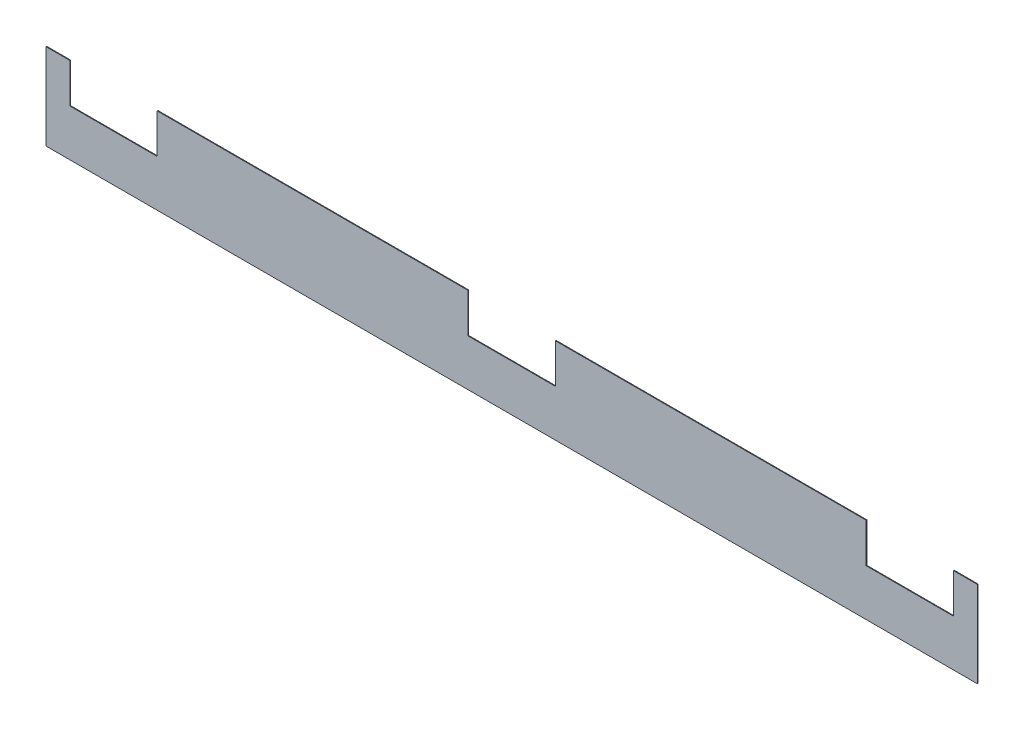
ISO-10303-21;
HEADER;
FILE_DESCRIPTION(('STEP AP214'),'2;1');
FILE_NAME('part.step','',(''),(''),'','','');
FILE_SCHEMA(('AUTOMOTIVE_DESIGN { 1 0 10303 214 1 1 1 1 }'));
ENDSEC;
DATA;
#1=APPLICATION_CONTEXT('core data for automotive mechanical design processes');
#2=APPLICATION_PROTOCOL_DEFINITION('international standard','automotive_design',2000,#1);
#3=PRODUCT_CONTEXT('',#1,'mechanical');
#4=PRODUCT('Part','Part','',(#3));
#5=PRODUCT_RELATED_PRODUCT_CATEGORY('part','',(#4));
#6=PRODUCT_DEFINITION_FORMATION('','',#4);
#7=PRODUCT_DEFINITION_CONTEXT('part definition',#1,'design');
#8=PRODUCT_DEFINITION('design','',#6,#7);
#9=PRODUCT_DEFINITION_SHAPE('','',#8);
#10=(LENGTH_UNIT() NAMED_UNIT(*) SI_UNIT(.MILLI.,.METRE.));
#11=(NAMED_UNIT(*) PLANE_ANGLE_UNIT() SI_UNIT($,.RADIAN.));
#12=(NAMED_UNIT(*) SI_UNIT($,.STERADIAN.) SOLID_ANGLE_UNIT());
#13=UNCERTAINTY_MEASURE_WITH_UNIT(LENGTH_MEASURE(1.E-05),#10,'distance_accuracy_value','');
#14=(GEOMETRIC_REPRESENTATION_CONTEXT(3) GLOBAL_UNCERTAINTY_ASSIGNED_CONTEXT((#13)) GLOBAL_UNIT_ASSIGNED_CONTEXT((#10,
#11,#12)) REPRESENTATION_CONTEXT('',''));
#15=CARTESIAN_POINT('',(0.,0.,0.));
#16=DIRECTION('',(0.,0.,1.));
#17=DIRECTION('',(1.,0.,0.));
#18=AXIS2_PLACEMENT_3D('',#15,#16,#17);
#19=CARTESIAN_POINT('',(0.,360.,3.));
#20=DIRECTION('',(-1.,0.,0.));
#21=DIRECTION('',(0.,-1.,0.));
#22=AXIS2_PLACEMENT_3D('',#19,#20,#21);
#23=PLANE('',#22);
#24=DIRECTION('',(0.,1.,0.));
#25=VECTOR('',#24,1.);
#26=CARTESIAN_POINT('',(0.,360.,0.));
#27=LINE('',#26,#25);
#28=CARTESIAN_POINT('',(0.,0.,0.));
#29=VERTEX_POINT('',#28);
#30=CARTESIAN_POINT('',(0.,360.,0.));
#31=VERTEX_POINT('',#30);
#32=EDGE_CURVE('E177',#29,#31,#27,.T.);
#33=ORIENTED_EDGE('',*,*,#32,.T.);
#34=DIRECTION('',(0.,0.,-1.));
#35=VECTOR('',#34,1.);
#36=CARTESIAN_POINT('',(0.,360.,3.));
#37=LINE('',#36,#35);
#38=CARTESIAN_POINT('',(0.,360.,3.));
#39=VERTEX_POINT('',#38);
#40=EDGE_CURVE('E11',#39,#31,#37,.T.);
#41=ORIENTED_EDGE('',*,*,#40,.F.);
#42=DIRECTION('',(0.,1.,0.));
#43=VECTOR('',#42,1.);
#44=CARTESIAN_POINT('',(0.,360.,3.));
#45=LINE('',#44,#43);
#46=CARTESIAN_POINT('',(0.,0.,3.));
#47=VERTEX_POINT('',#46);
#48=EDGE_CURVE('E207',#47,#39,#45,.T.);
#49=ORIENTED_EDGE('',*,*,#48,.F.);
#50=DIRECTION('',(0.,0.,-1.));
#51=VECTOR('',#50,1.);
#52=CARTESIAN_POINT('',(0.,0.,3.));
#53=LINE('',#52,#51);
#54=EDGE_CURVE('E173',#47,#29,#53,.T.);
#55=ORIENTED_EDGE('',*,*,#54,.T.);
#56=EDGE_LOOP('',(#33,#41,#49,#55));
#57=FACE_BOUND('',#56,.T.);
#58=ADVANCED_FACE('F33',(#57),#23,.F.);
#59=CARTESIAN_POINT('',(-100.,360.,3.));
#60=DIRECTION('',(0.,-1.,0.));
#61=DIRECTION('',(0.,0.,-1.));
#62=AXIS2_PLACEMENT_3D('',#59,#60,#61);
#63=PLANE('',#62);
#64=DIRECTION('',(-1.,0.,0.));
#65=VECTOR('',#64,1.);
#66=CARTESIAN_POINT('',(-100.,360.,0.));
#67=LINE('',#66,#65);
#68=CARTESIAN_POINT('',(-100.,360.,0.));
#69=VERTEX_POINT('',#68);
#70=EDGE_CURVE('E180',#31,#69,#67,.T.);
#71=ORIENTED_EDGE('',*,*,#70,.T.);
#72=DIRECTION('',(0.,0.,-1.));
#73=VECTOR('',#72,1.);
#74=CARTESIAN_POINT('',(-100.,360.,3.));
#75=LINE('',#74,#73);
#76=CARTESIAN_POINT('',(-100.,360.,3.));
#77=VERTEX_POINT('',#76);
#78=EDGE_CURVE('E41',#77,#69,#75,.T.);
#79=ORIENTED_EDGE('',*,*,#78,.F.);
#80=DIRECTION('',(-1.,0.,0.));
#81=VECTOR('',#80,1.);
#82=CARTESIAN_POINT('',(-100.,360.,3.));
#83=LINE('',#82,#81);
#84=EDGE_CURVE('E116',#39,#77,#83,.T.);
#85=ORIENTED_EDGE('',*,*,#84,.F.);
#86=ORIENTED_EDGE('',*,*,#40,.T.);
#87=EDGE_LOOP('',(#71,#79,#85,#86));
#88=FACE_BOUND('',#87,.T.);
#89=ADVANCED_FACE('F305',(#88),#63,.F.);
#90=CARTESIAN_POINT('',(-100.,195.,3.));
#91=DIRECTION('',(1.,0.,0.));
#92=DIRECTION('',(0.,0.,-1.));
#93=AXIS2_PLACEMENT_3D('',#90,#91,#92);
#94=PLANE('',#93);
#95=DIRECTION('',(0.,-1.,0.));
#96=VECTOR('',#95,1.);
#97=CARTESIAN_POINT('',(-100.,195.,0.));
#98=LINE('',#97,#96);
#99=CARTESIAN_POINT('',(-100.,195.,0.));
#100=VERTEX_POINT('',#99);
#101=EDGE_CURVE('E182',#69,#100,#98,.T.);
#102=ORIENTED_EDGE('',*,*,#101,.T.);
#103=DIRECTION('',(0.,0.,-1.));
#104=VECTOR('',#103,1.);
#105=CARTESIAN_POINT('',(-100.,195.,3.));
#106=LINE('',#105,#104);
#107=CARTESIAN_POINT('',(-100.,195.,3.));
#108=VERTEX_POINT('',#107);
#109=EDGE_CURVE('E238',#108,#100,#106,.T.);
#110=ORIENTED_EDGE('',*,*,#109,.F.);
#111=DIRECTION('',(0.,-1.,0.));
#112=VECTOR('',#111,1.);
#113=CARTESIAN_POINT('',(-100.,195.,3.));
#114=LINE('',#113,#112);
#115=EDGE_CURVE('E246',#77,#108,#114,.T.);
#116=ORIENTED_EDGE('',*,*,#115,.F.);
#117=ORIENTED_EDGE('',*,*,#78,.T.);
#118=EDGE_LOOP('',(#102,#110,#116,#117));
#119=FACE_BOUND('',#118,.T.);
#120=ADVANCED_FACE('F244',(#119),#94,.F.);
#121=CARTESIAN_POINT('',(-465.,195.,3.));
#122=DIRECTION('',(0.,-1.,0.));
#123=DIRECTION('',(1.,0.,0.));
#124=AXIS2_PLACEMENT_3D('',#121,#122,#123);
#125=PLANE('',#124);
#126=DIRECTION('',(-1.,0.,0.));
#127=VECTOR('',#126,1.);
#128=CARTESIAN_POINT('',(-465.,195.,0.));
#129=LINE('',#128,#127);
#130=CARTESIAN_POINT('',(-465.,195.,0.));
#131=VERTEX_POINT('',#130);
#132=EDGE_CURVE('E184',#100,#131,#129,.T.);
#133=ORIENTED_EDGE('',*,*,#132,.T.);
#134=DIRECTION('',(0.,0.,-1.));
#135=VECTOR('',#134,1.);
#136=CARTESIAN_POINT('',(-465.,195.,3.));
#137=LINE('',#136,#135);
#138=CARTESIAN_POINT('',(-465.,195.,3.));
#139=VERTEX_POINT('',#138);
#140=EDGE_CURVE('E235',#139,#131,#137,.T.);
#141=ORIENTED_EDGE('',*,*,#140,.F.);
#142=DIRECTION('',(-1.,0.,0.));
#143=VECTOR('',#142,1.);
#144=CARTESIAN_POINT('',(-465.,195.,3.));
#145=LINE('',#144,#143);
#146=EDGE_CURVE('E264',#108,#139,#145,.T.);
#147=ORIENTED_EDGE('',*,*,#146,.F.);
#148=ORIENTED_EDGE('',*,*,#109,.T.);
#149=EDGE_LOOP('',(#133,#141,#147,#148));
#150=FACE_BOUND('',#149,.T.);
#151=ADVANCED_FACE('F255',(#150),#125,.F.);
#152=CARTESIAN_POINT('',(-465.,360.,3.));
#153=DIRECTION('',(-1.,0.,0.));
#154=DIRECTION('',(0.,0.,1.));
#155=AXIS2_PLACEMENT_3D('',#152,#153,#154);
#156=PLANE('',#155);
#157=DIRECTION('',(0.,1.,0.));
#158=VECTOR('',#157,1.);
#159=CARTESIAN_POINT('',(-465.,360.,0.));
#160=LINE('',#159,#158);
#161=CARTESIAN_POINT('',(-465.,360.,0.));
#162=VERTEX_POINT('',#161);
#163=EDGE_CURVE('E186',#131,#162,#160,.T.);
#164=ORIENTED_EDGE('',*,*,#163,.T.);
#165=DIRECTION('',(0.,0.,-1.));
#166=VECTOR('',#165,1.);
#167=CARTESIAN_POINT('',(-465.,360.,3.));
#168=LINE('',#167,#166);
#169=CARTESIAN_POINT('',(-465.,360.,3.));
#170=VERTEX_POINT('',#169);
#171=EDGE_CURVE('E232',#170,#162,#168,.T.);
#172=ORIENTED_EDGE('',*,*,#171,.F.);
#173=DIRECTION('',(0.,1.,0.));
#174=VECTOR('',#173,1.);
#175=CARTESIAN_POINT('',(-465.,360.,3.));
#176=LINE('',#175,#174);
#177=EDGE_CURVE('E261',#139,#170,#176,.T.);
#178=ORIENTED_EDGE('',*,*,#177,.F.);
#179=ORIENTED_EDGE('',*,*,#140,.T.);
#180=EDGE_LOOP('',(#164,#172,#178,#179));
#181=FACE_BOUND('',#180,.T.);
#182=ADVANCED_FACE('F259',(#181),#156,.F.);
#183=CARTESIAN_POINT('',(-1765.,360.,3.));
#184=DIRECTION('',(0.,-1.,0.));
#185=DIRECTION('',(1.,0.,0.));
#186=AXIS2_PLACEMENT_3D('',#183,#184,#185);
#187=PLANE('',#186);
#188=DIRECTION('',(-1.,0.,0.));
#189=VECTOR('',#188,1.);
#190=CARTESIAN_POINT('',(-1765.,360.,0.));
#191=LINE('',#190,#189);
#192=CARTESIAN_POINT('',(-1765.,360.,0.));
#193=VERTEX_POINT('',#192);
#194=EDGE_CURVE('E188',#162,#193,#191,.T.);
#195=ORIENTED_EDGE('',*,*,#194,.T.);
#196=DIRECTION('',(0.,0.,-1.));
#197=VECTOR('',#196,1.);
#198=CARTESIAN_POINT('',(-1765.,360.,3.));
#199=LINE('',#198,#197);
#200=CARTESIAN_POINT('',(-1765.,360.,3.));
#201=VERTEX_POINT('',#200);
#202=EDGE_CURVE('E229',#201,#193,#199,.T.);
#203=ORIENTED_EDGE('',*,*,#202,.F.);
#204=DIRECTION('',(-1.,0.,0.));
#205=VECTOR('',#204,1.);
#206=CARTESIAN_POINT('',(-1765.,360.,3.));
#207=LINE('',#206,#205);
#208=EDGE_CURVE('E263',#170,#201,#207,.T.);
#209=ORIENTED_EDGE('',*,*,#208,.F.);
#210=ORIENTED_EDGE('',*,*,#171,.T.);
#211=EDGE_LOOP('',(#195,#203,#209,#210));
#212=FACE_BOUND('',#211,.T.);
#213=ADVANCED_FACE('F318',(#212),#187,.F.);
#214=CARTESIAN_POINT('',(-1765.,195.,3.));
#215=DIRECTION('',(1.,0.,0.));
#216=DIRECTION('',(0.,0.,-1.));
#217=AXIS2_PLACEMENT_3D('',#214,#215,#216);
#218=PLANE('',#217);
#219=DIRECTION('',(0.,-1.,0.));
#220=VECTOR('',#219,1.);
#221=CARTESIAN_POINT('',(-1765.,195.,0.));
#222=LINE('',#221,#220);
#223=CARTESIAN_POINT('',(-1765.,195.,0.));
#224=VERTEX_POINT('',#223);
#225=EDGE_CURVE('E190',#193,#224,#222,.T.);
#226=ORIENTED_EDGE('',*,*,#225,.T.);
#227=DIRECTION('',(0.,0.,-1.));
#228=VECTOR('',#227,1.);
#229=CARTESIAN_POINT('',(-1765.,195.,3.));
#230=LINE('',#229,#228);
#231=CARTESIAN_POINT('',(-1765.,195.,3.));
#232=VERTEX_POINT('',#231);
#233=EDGE_CURVE('E226',#232,#224,#230,.T.);
#234=ORIENTED_EDGE('',*,*,#233,.F.);
#235=DIRECTION('',(0.,-1.,0.));
#236=VECTOR('',#235,1.);
#237=CARTESIAN_POINT('',(-1765.,195.,3.));
#238=LINE('',#237,#236);
#239=EDGE_CURVE('E266',#201,#232,#238,.T.);
#240=ORIENTED_EDGE('',*,*,#239,.F.);
#241=ORIENTED_EDGE('',*,*,#202,.T.);
#242=EDGE_LOOP('',(#226,#234,#240,#241));
#243=FACE_BOUND('',#242,.T.);
#244=ADVANCED_FACE('F321',(#243),#218,.F.);
#245=CARTESIAN_POINT('',(-2130.,195.,3.));
#246=DIRECTION('',(0.,-1.,0.));
#247=DIRECTION('',(1.,0.,0.));
#248=AXIS2_PLACEMENT_3D('',#245,#246,#247);
#249=PLANE('',#248);
#250=DIRECTION('',(-1.,0.,0.));
#251=VECTOR('',#250,1.);
#252=CARTESIAN_POINT('',(-2130.,195.,0.));
#253=LINE('',#252,#251);
#254=CARTESIAN_POINT('',(-2130.,195.,0.));
#255=VERTEX_POINT('',#254);
#256=EDGE_CURVE('E192',#224,#255,#253,.T.);
#257=ORIENTED_EDGE('',*,*,#256,.T.);
#258=DIRECTION('',(0.,0.,-1.));
#259=VECTOR('',#258,1.);
#260=CARTESIAN_POINT('',(-2130.,195.,3.));
#261=LINE('',#260,#259);
#262=CARTESIAN_POINT('',(-2130.,195.,3.));
#263=VERTEX_POINT('',#262);
#264=EDGE_CURVE('E223',#263,#255,#261,.T.);
#265=ORIENTED_EDGE('',*,*,#264,.F.);
#266=DIRECTION('',(-1.,0.,0.));
#267=VECTOR('',#266,1.);
#268=CARTESIAN_POINT('',(-2130.,195.,3.));
#269=LINE('',#268,#267);
#270=EDGE_CURVE('E272',#232,#263,#269,.T.);
#271=ORIENTED_EDGE('',*,*,#270,.F.);
#272=ORIENTED_EDGE('',*,*,#233,.T.);
#273=EDGE_LOOP('',(#257,#265,#271,#272));
#274=FACE_BOUND('',#273,.T.);
#275=ADVANCED_FACE('F325',(#274),#249,.F.);
#276=CARTESIAN_POINT('',(-2130.,360.,3.));
#277=DIRECTION('',(-1.,0.,0.));
#278=DIRECTION('',(0.,0.,1.));
#279=AXIS2_PLACEMENT_3D('',#276,#277,#278);
#280=PLANE('',#279);
#281=DIRECTION('',(0.,1.,0.));
#282=VECTOR('',#281,1.);
#283=CARTESIAN_POINT('',(-2130.,360.,0.));
#284=LINE('',#283,#282);
#285=CARTESIAN_POINT('',(-2130.,360.,0.));
#286=VERTEX_POINT('',#285);
#287=EDGE_CURVE('E194',#255,#286,#284,.T.);
#288=ORIENTED_EDGE('',*,*,#287,.T.);
#289=DIRECTION('',(0.,0.,-1.));
#290=VECTOR('',#289,1.);
#291=CARTESIAN_POINT('',(-2130.,360.,3.));
#292=LINE('',#291,#290);
#293=CARTESIAN_POINT('',(-2130.,360.,3.));
#294=VERTEX_POINT('',#293);
#295=EDGE_CURVE('E220',#294,#286,#292,.T.);
#296=ORIENTED_EDGE('',*,*,#295,.F.);
#297=DIRECTION('',(0.,1.,0.));
#298=VECTOR('',#297,1.);
#299=CARTESIAN_POINT('',(-2130.,360.,3.));
#300=LINE('',#299,#298);
#301=EDGE_CURVE('E274',#263,#294,#300,.T.);
#302=ORIENTED_EDGE('',*,*,#301,.F.);
#303=ORIENTED_EDGE('',*,*,#264,.T.);
#304=EDGE_LOOP('',(#288,#296,#302,#303));
#305=FACE_BOUND('',#304,.T.);
#306=ADVANCED_FACE('F329',(#305),#280,.F.);
#307=CARTESIAN_POINT('',(-3430.,360.,3.));
#308=DIRECTION('',(0.,-1.,0.));
#309=DIRECTION('',(0.,0.,-1.));
#310=AXIS2_PLACEMENT_3D('',#307,#308,#309);
#311=PLANE('',#310);
#312=DIRECTION('',(-1.,0.,0.));
#313=VECTOR('',#312,1.);
#314=CARTESIAN_POINT('',(-3430.,360.,0.));
#315=LINE('',#314,#313);
#316=CARTESIAN_POINT('',(-3430.,360.,0.));
#317=VERTEX_POINT('',#316);
#318=EDGE_CURVE('E196',#286,#317,#315,.T.);
#319=ORIENTED_EDGE('',*,*,#318,.T.);
#320=DIRECTION('',(0.,0.,-1.));
#321=VECTOR('',#320,1.);
#322=CARTESIAN_POINT('',(-3430.,360.,3.));
#323=LINE('',#322,#321);
#324=CARTESIAN_POINT('',(-3430.,360.,3.));
#325=VERTEX_POINT('',#324);
#326=EDGE_CURVE('E217',#325,#317,#323,.T.);
#327=ORIENTED_EDGE('',*,*,#326,.F.);
#328=DIRECTION('',(-1.,0.,0.));
#329=VECTOR('',#328,1.);
#330=CARTESIAN_POINT('',(-3430.,360.,3.));
#331=LINE('',#330,#329);
#332=EDGE_CURVE('E276',#294,#325,#331,.T.);
#333=ORIENTED_EDGE('',*,*,#332,.F.);
#334=ORIENTED_EDGE('',*,*,#295,.T.);
#335=EDGE_LOOP('',(#319,#327,#333,#334));
#336=FACE_BOUND('',#335,.T.);
#337=ADVANCED_FACE('F333',(#336),#311,.F.);
#338=CARTESIAN_POINT('',(-3430.,195.,3.));
#339=DIRECTION('',(1.,0.,0.));
#340=DIRECTION('',(0.,0.,-1.));
#341=AXIS2_PLACEMENT_3D('',#338,#339,#340);
#342=PLANE('',#341);
#343=DIRECTION('',(0.,-1.,0.));
#344=VECTOR('',#343,1.);
#345=CARTESIAN_POINT('',(-3430.,195.,0.));
#346=LINE('',#345,#344);
#347=CARTESIAN_POINT('',(-3430.,195.,0.));
#348=VERTEX_POINT('',#347);
#349=EDGE_CURVE('E198',#317,#348,#346,.T.);
#350=ORIENTED_EDGE('',*,*,#349,.T.);
#351=DIRECTION('',(0.,0.,-1.));
#352=VECTOR('',#351,1.);
#353=CARTESIAN_POINT('',(-3430.,195.,3.));
#354=LINE('',#353,#352);
#355=CARTESIAN_POINT('',(-3430.,195.,3.));
#356=VERTEX_POINT('',#355);
#357=EDGE_CURVE('E214',#356,#348,#354,.T.);
#358=ORIENTED_EDGE('',*,*,#357,.F.);
#359=DIRECTION('',(0.,-1.,0.));
#360=VECTOR('',#359,1.);
#361=CARTESIAN_POINT('',(-3430.,195.,3.));
#362=LINE('',#361,#360);
#363=EDGE_CURVE('E278',#325,#356,#362,.T.);
#364=ORIENTED_EDGE('',*,*,#363,.F.);
#365=ORIENTED_EDGE('',*,*,#326,.T.);
#366=EDGE_LOOP('',(#350,#358,#364,#365));
#367=FACE_BOUND('',#366,.T.);
#368=ADVANCED_FACE('F337',(#367),#342,.F.);
#369=CARTESIAN_POINT('',(-3795.,195.,3.));
#370=DIRECTION('',(0.,-1.,0.));
#371=DIRECTION('',(1.,0.,0.));
#372=AXIS2_PLACEMENT_3D('',#369,#370,#371);
#373=PLANE('',#372);
#374=DIRECTION('',(-1.,0.,0.));
#375=VECTOR('',#374,1.);
#376=CARTESIAN_POINT('',(-3795.,195.,0.));
#377=LINE('',#376,#375);
#378=CARTESIAN_POINT('',(-3795.,195.,0.));
#379=VERTEX_POINT('',#378);
#380=EDGE_CURVE('E200',#348,#379,#377,.T.);
#381=ORIENTED_EDGE('',*,*,#380,.T.);
#382=DIRECTION('',(0.,0.,-1.));
#383=VECTOR('',#382,1.);
#384=CARTESIAN_POINT('',(-3795.,195.,3.));
#385=LINE('',#384,#383);
#386=CARTESIAN_POINT('',(-3795.,195.,3.));
#387=VERTEX_POINT('',#386);
#388=EDGE_CURVE('E211',#387,#379,#385,.T.);
#389=ORIENTED_EDGE('',*,*,#388,.F.);
#390=DIRECTION('',(-1.,0.,0.));
#391=VECTOR('',#390,1.);
#392=CARTESIAN_POINT('',(-3795.,195.,3.));
#393=LINE('',#392,#391);
#394=EDGE_CURVE('E280',#356,#387,#393,.T.);
#395=ORIENTED_EDGE('',*,*,#394,.F.);
#396=ORIENTED_EDGE('',*,*,#357,.T.);
#397=EDGE_LOOP('',(#381,#389,#395,#396));
#398=FACE_BOUND('',#397,.T.);
#399=ADVANCED_FACE('F286',(#398),#373,.F.);
#400=CARTESIAN_POINT('',(-3795.,360.,3.));
#401=DIRECTION('',(-1.,0.,0.));
#402=DIRECTION('',(0.,0.,1.));
#403=AXIS2_PLACEMENT_3D('',#400,#401,#402);
#404=PLANE('',#403);
#405=DIRECTION('',(0.,1.,0.));
#406=VECTOR('',#405,1.);
#407=CARTESIAN_POINT('',(-3795.,360.,0.));
#408=LINE('',#407,#406);
#409=CARTESIAN_POINT('',(-3795.,360.,0.));
#410=VERTEX_POINT('',#409);
#411=EDGE_CURVE('E202',#379,#410,#408,.T.);
#412=ORIENTED_EDGE('',*,*,#411,.T.);
#413=DIRECTION('',(0.,0.,-1.));
#414=VECTOR('',#413,1.);
#415=CARTESIAN_POINT('',(-3795.,360.,3.));
#416=LINE('',#415,#414);
#417=CARTESIAN_POINT('',(-3795.,360.,3.));
#418=VERTEX_POINT('',#417);
#419=EDGE_CURVE('E168',#418,#410,#416,.T.);
#420=ORIENTED_EDGE('',*,*,#419,.F.);
#421=DIRECTION('',(0.,1.,0.));
#422=VECTOR('',#421,1.);
#423=CARTESIAN_POINT('',(-3795.,360.,3.));
#424=LINE('',#423,#422);
#425=EDGE_CURVE('E159',#387,#418,#424,.T.);
#426=ORIENTED_EDGE('',*,*,#425,.F.);
#427=ORIENTED_EDGE('',*,*,#388,.T.);
#428=EDGE_LOOP('',(#412,#420,#426,#427));
#429=FACE_BOUND('',#428,.T.);
#430=ADVANCED_FACE('F290',(#429),#404,.F.);
#431=CARTESIAN_POINT('',(-3895.,360.,3.));
#432=DIRECTION('',(0.,-1.,0.));
#433=DIRECTION('',(1.,0.,0.));
#434=AXIS2_PLACEMENT_3D('',#431,#432,#433);
#435=PLANE('',#434);
#436=DIRECTION('',(-1.,0.,0.));
#437=VECTOR('',#436,1.);
#438=CARTESIAN_POINT('',(-3895.,360.,0.));
#439=LINE('',#438,#437);
#440=CARTESIAN_POINT('',(-3895.,360.,0.));
#441=VERTEX_POINT('',#440);
#442=EDGE_CURVE('E167',#410,#441,#439,.T.);
#443=ORIENTED_EDGE('',*,*,#442,.T.);
#444=DIRECTION('',(0.,0.,-1.));
#445=VECTOR('',#444,1.);
#446=CARTESIAN_POINT('',(-3895.,360.,3.));
#447=LINE('',#446,#445);
#448=CARTESIAN_POINT('',(-3895.,360.,3.));
#449=VERTEX_POINT('',#448);
#450=EDGE_CURVE('E164',#449,#441,#447,.T.);
#451=ORIENTED_EDGE('',*,*,#450,.F.);
#452=DIRECTION('',(-1.,0.,0.));
#453=VECTOR('',#452,1.);
#454=CARTESIAN_POINT('',(-3895.,360.,3.));
#455=LINE('',#454,#453);
#456=EDGE_CURVE('E153',#418,#449,#455,.T.);
#457=ORIENTED_EDGE('',*,*,#456,.F.);
#458=ORIENTED_EDGE('',*,*,#419,.T.);
#459=EDGE_LOOP('',(#443,#451,#457,#458));
#460=FACE_BOUND('',#459,.T.);
#461=ADVANCED_FACE('F165',(#460),#435,.F.);
#462=CARTESIAN_POINT('',(-3895.,-8.63375993398884E-13,3.));
#463=DIRECTION('',(1.,0.,0.));
#464=DIRECTION('',(0.,0.,-1.));
#465=AXIS2_PLACEMENT_3D('',#462,#463,#464);
#466=PLANE('',#465);
#467=DIRECTION('',(0.,-1.,0.));
#468=VECTOR('',#467,1.);
#469=CARTESIAN_POINT('',(-3895.,-8.63375993398884E-13,0.));
#470=LINE('',#469,#468);
#471=CARTESIAN_POINT('',(-3895.,-8.63375993398884E-13,0.));
#472=VERTEX_POINT('',#471);
#473=EDGE_CURVE('E102',#441,#472,#470,.T.);
#474=ORIENTED_EDGE('',*,*,#473,.T.);
#475=DIRECTION('',(0.,0.,-1.));
#476=VECTOR('',#475,1.);
#477=CARTESIAN_POINT('',(-3895.,-8.63375993398884E-13,3.));
#478=LINE('',#477,#476);
#479=CARTESIAN_POINT('',(-3895.,-8.63375993398884E-13,3.));
#480=VERTEX_POINT('',#479);
#481=EDGE_CURVE('E169',#480,#472,#478,.T.);
#482=ORIENTED_EDGE('',*,*,#481,.F.);
#483=DIRECTION('',(0.,-1.,0.));
#484=VECTOR('',#483,1.);
#485=CARTESIAN_POINT('',(-3895.,-8.63375993398884E-13,3.));
#486=LINE('',#485,#484);
#487=EDGE_CURVE('E157',#449,#480,#486,.T.);
#488=ORIENTED_EDGE('',*,*,#487,.F.);
#489=ORIENTED_EDGE('',*,*,#450,.T.);
#490=EDGE_LOOP('',(#474,#482,#488,#489));
#491=FACE_BOUND('',#490,.T.);
#492=ADVANCED_FACE('F171',(#491),#466,.F.);
#493=CARTESIAN_POINT('',(0.,0.,3.));
#494=DIRECTION('',(0.,1.,0.));
#495=DIRECTION('',(-1.,0.,0.));
#496=AXIS2_PLACEMENT_3D('',#493,#494,#495);
#497=PLANE('',#496);
#498=DIRECTION('',(1.,0.,0.));
#499=VECTOR('',#498,1.);
#500=CARTESIAN_POINT('',(0.,0.,0.));
#501=LINE('',#500,#499);
#502=EDGE_CURVE('E108',#472,#29,#501,.T.);
#503=ORIENTED_EDGE('',*,*,#502,.T.);
#504=ORIENTED_EDGE('',*,*,#54,.F.);
#505=DIRECTION('',(1.,0.,0.));
#506=VECTOR('',#505,1.);
#507=CARTESIAN_POINT('',(0.,0.,3.));
#508=LINE('',#507,#506);
#509=EDGE_CURVE('E49',#480,#47,#508,.T.);
#510=ORIENTED_EDGE('',*,*,#509,.F.);
#511=ORIENTED_EDGE('',*,*,#481,.T.);
#512=EDGE_LOOP('',(#503,#504,#510,#511));
#513=FACE_BOUND('',#512,.T.);
#514=ADVANCED_FACE('F294',(#513),#497,.F.);
#515=CARTESIAN_POINT('',(0.,0.,3.));
#516=DIRECTION('',(0.,0.,-1.));
#517=DIRECTION('',(-1.,0.,0.));
#518=AXIS2_PLACEMENT_3D('',#515,#516,#517);
#519=PLANE('',#518);
#520=ORIENTED_EDGE('',*,*,#48,.T.);
#521=ORIENTED_EDGE('',*,*,#84,.T.);
#522=ORIENTED_EDGE('',*,*,#115,.T.);
#523=ORIENTED_EDGE('',*,*,#146,.T.);
#524=ORIENTED_EDGE('',*,*,#177,.T.);
#525=ORIENTED_EDGE('',*,*,#208,.T.);
#526=ORIENTED_EDGE('',*,*,#239,.T.);
#527=ORIENTED_EDGE('',*,*,#270,.T.);
#528=ORIENTED_EDGE('',*,*,#301,.T.);
#529=ORIENTED_EDGE('',*,*,#332,.T.);
#530=ORIENTED_EDGE('',*,*,#363,.T.);
#531=ORIENTED_EDGE('',*,*,#394,.T.);
#532=ORIENTED_EDGE('',*,*,#425,.T.);
#533=ORIENTED_EDGE('',*,*,#456,.T.);
#534=ORIENTED_EDGE('',*,*,#487,.T.);
#535=ORIENTED_EDGE('',*,*,#509,.T.);
#536=EDGE_LOOP('',(#520,#521,#522,#523,#524,#525,#526,#527,#528,#529,#530,#531,#532,#533,#534,#535));
#537=FACE_BOUND('',#536,.T.);
#538=ADVANCED_FACE('F155',(#537),#519,.F.);
#539=CARTESIAN_POINT('',(0.,0.,0.));
#540=DIRECTION('',(0.,0.,-1.));
#541=DIRECTION('',(-1.,0.,0.));
#542=AXIS2_PLACEMENT_3D('',#539,#540,#541);
#543=PLANE('',#542);
#544=ORIENTED_EDGE('',*,*,#32,.F.);
#545=ORIENTED_EDGE('',*,*,#502,.F.);
#546=ORIENTED_EDGE('',*,*,#473,.F.);
#547=ORIENTED_EDGE('',*,*,#442,.F.);
#548=ORIENTED_EDGE('',*,*,#411,.F.);
#549=ORIENTED_EDGE('',*,*,#380,.F.);
#550=ORIENTED_EDGE('',*,*,#349,.F.);
#551=ORIENTED_EDGE('',*,*,#318,.F.);
#552=ORIENTED_EDGE('',*,*,#287,.F.);
#553=ORIENTED_EDGE('',*,*,#256,.F.);
#554=ORIENTED_EDGE('',*,*,#225,.F.);
#555=ORIENTED_EDGE('',*,*,#194,.F.);
#556=ORIENTED_EDGE('',*,*,#163,.F.);
#557=ORIENTED_EDGE('',*,*,#132,.F.);
#558=ORIENTED_EDGE('',*,*,#101,.F.);
#559=ORIENTED_EDGE('',*,*,#70,.F.);
#560=EDGE_LOOP('',(#544,#545,#546,#547,#548,#549,#550,#551,#552,#553,#554,#555,#556,#557,#558,#559));
#561=FACE_BOUND('',#560,.T.);
#562=ADVANCED_FACE('F250',(#561),#543,.T.);
#563=CLOSED_SHELL('',(#58,#89,#120,#151,#182,#213,#244,#275,#306,#337,#368,#399,#430,#461,#492,
#514,#538,#562));
#564=MANIFOLD_SOLID_BREP('B2',#563);
#565=ADVANCED_BREP_SHAPE_REPRESENTATION('',(#18,#564),#14);
#566=SHAPE_DEFINITION_REPRESENTATION(#9,#565);
ENDSEC;
END-ISO-10303-21;
